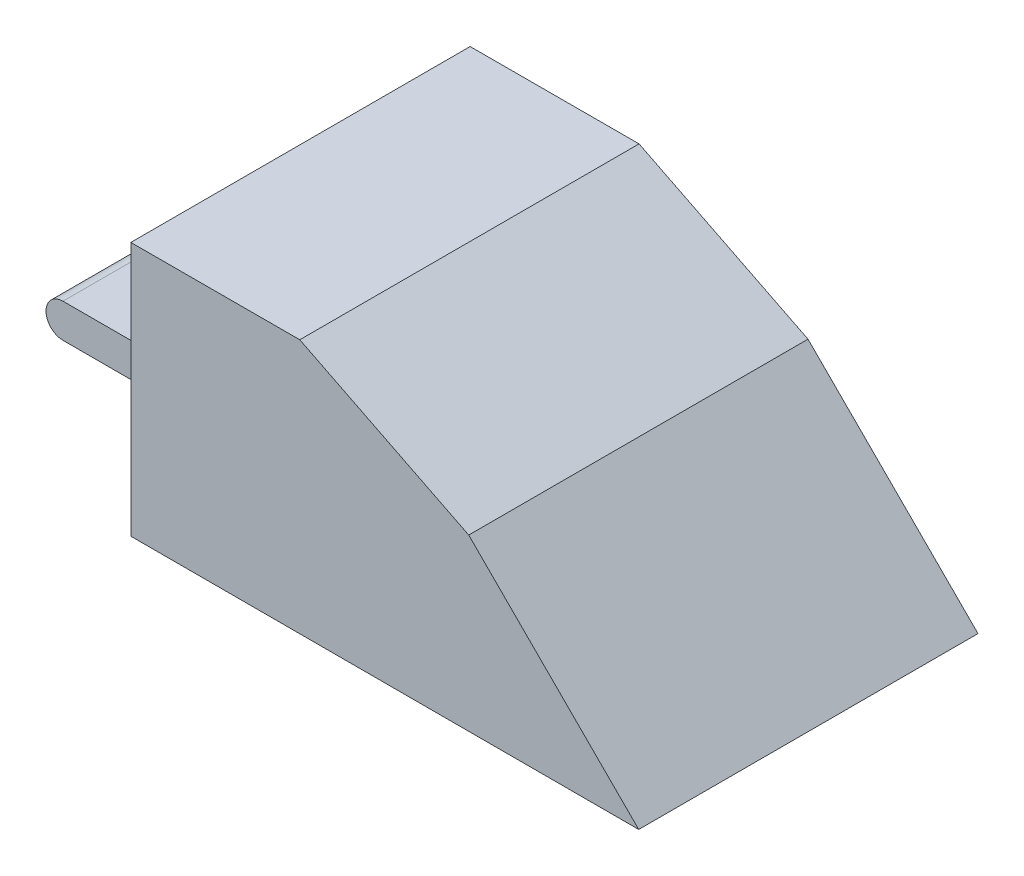
ISO-10303-21;
HEADER;
FILE_DESCRIPTION(('STEP AP214'),'2;1');
FILE_NAME('part.step','',(''),(''),'','','');
FILE_SCHEMA(('AUTOMOTIVE_DESIGN { 1 0 10303 214 1 1 1 1 }'));
ENDSEC;
DATA;
#1=APPLICATION_CONTEXT('core data for automotive mechanical design processes');
#2=APPLICATION_PROTOCOL_DEFINITION('international standard','automotive_design',2000,#1);
#3=PRODUCT_CONTEXT('',#1,'mechanical');
#4=PRODUCT('Part','Part','',(#3));
#5=PRODUCT_RELATED_PRODUCT_CATEGORY('part','',(#4));
#6=PRODUCT_DEFINITION_FORMATION('','',#4);
#7=PRODUCT_DEFINITION_CONTEXT('part definition',#1,'design');
#8=PRODUCT_DEFINITION('design','',#6,#7);
#9=PRODUCT_DEFINITION_SHAPE('','',#8);
#10=(LENGTH_UNIT() NAMED_UNIT(*) SI_UNIT(.MILLI.,.METRE.));
#11=(NAMED_UNIT(*) PLANE_ANGLE_UNIT() SI_UNIT($,.RADIAN.));
#12=(NAMED_UNIT(*) SI_UNIT($,.STERADIAN.) SOLID_ANGLE_UNIT());
#13=UNCERTAINTY_MEASURE_WITH_UNIT(LENGTH_MEASURE(1.E-05),#10,'distance_accuracy_value','');
#14=(GEOMETRIC_REPRESENTATION_CONTEXT(3) GLOBAL_UNCERTAINTY_ASSIGNED_CONTEXT((#13)) GLOBAL_UNIT_ASSIGNED_CONTEXT((#10,
#11,#12)) REPRESENTATION_CONTEXT('',''));
#15=CARTESIAN_POINT('',(0.,0.,0.));
#16=DIRECTION('',(0.,0.,1.));
#17=DIRECTION('',(1.,0.,0.));
#18=AXIS2_PLACEMENT_3D('',#15,#16,#17);
#19=CARTESIAN_POINT('',(-1.99999999999999,20.,-10.));
#20=DIRECTION('',(1.,0.,0.));
#21=DIRECTION('',(0.,0.,-1.));
#22=AXIS2_PLACEMENT_3D('',#19,#20,#21);
#23=PLANE('',#22);
#24=DIRECTION('',(0.,-1.,0.));
#25=VECTOR('',#24,1.);
#26=CARTESIAN_POINT('',(-1.99999999999999,20.,10.));
#27=LINE('',#26,#25);
#28=CARTESIAN_POINT('',(-1.99999999999999,15.,10.));
#29=VERTEX_POINT('',#28);
#30=CARTESIAN_POINT('',(-1.99999999999999,0.,10.));
#31=VERTEX_POINT('',#30);
#32=EDGE_CURVE('E41',#29,#31,#27,.T.);
#33=ORIENTED_EDGE('',*,*,#32,.F.);
#34=DIRECTION('',(0.,0.,1.));
#35=VECTOR('',#34,1.);
#36=CARTESIAN_POINT('',(-1.99999999999999,15.,-10.));
#37=LINE('',#36,#35);
#38=CARTESIAN_POINT('',(-1.99999999999999,15.,-10.));
#39=VERTEX_POINT('',#38);
#40=EDGE_CURVE('E120',#39,#29,#37,.T.);
#41=ORIENTED_EDGE('',*,*,#40,.F.);
#42=DIRECTION('',(0.,-1.,0.));
#43=VECTOR('',#42,1.);
#44=CARTESIAN_POINT('',(-1.99999999999999,20.,-10.));
#45=LINE('',#44,#43);
#46=CARTESIAN_POINT('',(-1.99999999999999,0.,-10.));
#47=VERTEX_POINT('',#46);
#48=EDGE_CURVE('E130',#39,#47,#45,.T.);
#49=ORIENTED_EDGE('',*,*,#48,.T.);
#50=DIRECTION('',(0.,0.,1.));
#51=VECTOR('',#50,1.);
#52=CARTESIAN_POINT('',(-1.99999999999999,0.,-10.));
#53=LINE('',#52,#51);
#54=CARTESIAN_POINT('',(-1.99999999999999,0.,-4.));
#55=VERTEX_POINT('',#54);
#56=EDGE_CURVE('E146',#47,#55,#53,.T.);
#57=ORIENTED_EDGE('',*,*,#56,.T.);
#58=DIRECTION('',(0.,-1.,0.));
#59=VECTOR('',#58,1.);
#60=CARTESIAN_POINT('',(-1.99999999999999,0.,-4.));
#61=LINE('',#60,#59);
#62=CARTESIAN_POINT('',(-1.99999999999999,4.,-4.));
#63=VERTEX_POINT('',#62);
#64=EDGE_CURVE('E56',#63,#55,#61,.T.);
#65=ORIENTED_EDGE('',*,*,#64,.F.);
#66=DIRECTION('',(0.,0.,-1.));
#67=VECTOR('',#66,1.);
#68=CARTESIAN_POINT('',(-1.99999999999999,4.,-4.));
#69=LINE('',#68,#67);
#70=CARTESIAN_POINT('',(-1.99999999999999,4.,4.));
#71=VERTEX_POINT('',#70);
#72=EDGE_CURVE('E160',#71,#63,#69,.T.);
#73=ORIENTED_EDGE('',*,*,#72,.F.);
#74=DIRECTION('',(0.,1.,0.));
#75=VECTOR('',#74,1.);
#76=CARTESIAN_POINT('',(-1.99999999999999,0.,4.));
#77=LINE('',#76,#75);
#78=CARTESIAN_POINT('',(-1.99999999999999,0.,4.));
#79=VERTEX_POINT('',#78);
#80=EDGE_CURVE('E162',#79,#71,#77,.T.);
#81=ORIENTED_EDGE('',*,*,#80,.F.);
#82=EDGE_CURVE('E148',#79,#31,#53,.T.);
#83=ORIENTED_EDGE('',*,*,#82,.T.);
#84=EDGE_LOOP('',(#33,#41,#49,#57,#65,#73,#81,#83));
#85=FACE_BOUND('',#84,.T.);
#86=ADVANCED_FACE('F34',(#85),#23,.F.);
#87=CARTESIAN_POINT('',(-1.99999999999999,20.,10.));
#88=DIRECTION('',(0.,0.,-1.));
#89=DIRECTION('',(-1.,0.,0.));
#90=AXIS2_PLACEMENT_3D('',#87,#88,#89);
#91=PLANE('',#90);
#92=DIRECTION('',(1.,0.,0.));
#93=VECTOR('',#92,1.);
#94=CARTESIAN_POINT('',(-1.99999999999999,0.,10.));
#95=LINE('',#94,#93);
#96=CARTESIAN_POINT('',(27.9390915984607,0.,10.));
#97=VERTEX_POINT('',#96);
#98=EDGE_CURVE('E141',#31,#97,#95,.T.);
#99=ORIENTED_EDGE('',*,*,#98,.T.);
#100=DIRECTION('',(0.707106781186556,-0.707106781186539,0.));
#101=VECTOR('',#100,1.);
#102=CARTESIAN_POINT('',(17.9187887979473,10.0203028005132,10.));
#103=LINE('',#102,#101);
#104=CARTESIAN_POINT('',(17.9187887979473,10.0203028005132,10.));
#105=VERTEX_POINT('',#104);
#106=EDGE_CURVE('E48',#105,#97,#103,.T.);
#107=ORIENTED_EDGE('',*,*,#106,.F.);
#108=DIRECTION('',(0.894062374329235,-0.44794248605013,0.));
#109=VECTOR('',#108,1.);
#110=CARTESIAN_POINT('',(17.9187887979473,10.0203028005132,10.));
#111=LINE('',#110,#109);
#112=CARTESIAN_POINT('',(7.95939439897367,15.0101514002566,10.));
#113=VERTEX_POINT('',#112);
#114=EDGE_CURVE('E195',#113,#105,#111,.T.);
#115=ORIENTED_EDGE('',*,*,#114,.F.);
#116=DIRECTION('',(0.999999480535699,0.00101927833928746,0.));
#117=VECTOR('',#116,1.);
#118=CARTESIAN_POINT('',(-1.99999999999999,15.,10.));
#119=LINE('',#118,#117);
#120=EDGE_CURVE('E198',#29,#113,#119,.T.);
#121=ORIENTED_EDGE('',*,*,#120,.F.);
#122=ORIENTED_EDGE('',*,*,#32,.T.);
#123=EDGE_LOOP('',(#99,#107,#115,#121,#122));
#124=FACE_BOUND('',#123,.T.);
#125=ADVANCED_FACE('F211',(#124),#91,.F.);
#126=CARTESIAN_POINT('',(-1.99999999999999,20.,-10.));
#127=DIRECTION('',(0.,0.,1.));
#128=DIRECTION('',(1.,0.,0.));
#129=AXIS2_PLACEMENT_3D('',#126,#127,#128);
#130=PLANE('',#129);
#131=DIRECTION('',(0.894062374329235,-0.44794248605013,0.));
#132=VECTOR('',#131,1.);
#133=CARTESIAN_POINT('',(17.9187887979473,10.0203028005132,-10.));
#134=LINE('',#133,#132);
#135=CARTESIAN_POINT('',(7.95939439897367,15.0101514002566,-10.));
#136=VERTEX_POINT('',#135);
#137=CARTESIAN_POINT('',(17.9187887979473,10.0203028005132,-10.));
#138=VERTEX_POINT('',#137);
#139=EDGE_CURVE('E127',#136,#138,#134,.T.);
#140=ORIENTED_EDGE('',*,*,#139,.T.);
#141=DIRECTION('',(0.707106781186556,-0.707106781186539,0.));
#142=VECTOR('',#141,1.);
#143=CARTESIAN_POINT('',(17.9187887979473,10.0203028005132,-10.));
#144=LINE('',#143,#142);
#145=CARTESIAN_POINT('',(27.9390915984607,0.,-10.));
#146=VERTEX_POINT('',#145);
#147=EDGE_CURVE('E133',#138,#146,#144,.T.);
#148=ORIENTED_EDGE('',*,*,#147,.T.);
#149=DIRECTION('',(-1.,0.,0.));
#150=VECTOR('',#149,1.);
#151=CARTESIAN_POINT('',(-1.99999999999999,0.,-10.));
#152=LINE('',#151,#150);
#153=EDGE_CURVE('E138',#146,#47,#152,.T.);
#154=ORIENTED_EDGE('',*,*,#153,.T.);
#155=ORIENTED_EDGE('',*,*,#48,.F.);
#156=DIRECTION('',(0.999999480535699,0.00101927833928746,0.));
#157=VECTOR('',#156,1.);
#158=CARTESIAN_POINT('',(-1.99999999999999,15.,-10.));
#159=LINE('',#158,#157);
#160=EDGE_CURVE('E116',#39,#136,#159,.T.);
#161=ORIENTED_EDGE('',*,*,#160,.T.);
#162=EDGE_LOOP('',(#140,#148,#154,#155,#161));
#163=FACE_BOUND('',#162,.T.);
#164=ADVANCED_FACE('F135',(#163),#130,.F.);
#165=CARTESIAN_POINT('',(0.,0.,0.));
#166=DIRECTION('',(0.,1.,0.));
#167=DIRECTION('',(0.,0.,1.));
#168=AXIS2_PLACEMENT_3D('',#165,#166,#167);
#169=PLANE('',#168);
#170=ORIENTED_EDGE('',*,*,#153,.F.);
#171=DIRECTION('',(0.,0.,1.));
#172=VECTOR('',#171,1.);
#173=CARTESIAN_POINT('',(27.9390915984607,0.,-10.));
#174=LINE('',#173,#172);
#175=EDGE_CURVE('E187',#146,#97,#174,.T.);
#176=ORIENTED_EDGE('',*,*,#175,.T.);
#177=ORIENTED_EDGE('',*,*,#98,.F.);
#178=ORIENTED_EDGE('',*,*,#82,.F.);
#179=DIRECTION('',(1.,0.,0.));
#180=VECTOR('',#179,1.);
#181=CARTESIAN_POINT('',(-12.,0.,4.));
#182=LINE('',#181,#180);
#183=CARTESIAN_POINT('',(-5.,0.,4.));
#184=VERTEX_POINT('',#183);
#185=EDGE_CURVE('E151',#184,#79,#182,.T.);
#186=ORIENTED_EDGE('',*,*,#185,.F.);
#187=DIRECTION('',(0.,0.,1.));
#188=VECTOR('',#187,1.);
#189=CARTESIAN_POINT('',(-5.,0.,-16.));
#190=LINE('',#189,#188);
#191=CARTESIAN_POINT('',(-5.,0.,-4.));
#192=VERTEX_POINT('',#191);
#193=EDGE_CURVE('E174',#192,#184,#190,.T.);
#194=ORIENTED_EDGE('',*,*,#193,.F.);
#195=DIRECTION('',(1.,0.,0.));
#196=VECTOR('',#195,1.);
#197=CARTESIAN_POINT('',(-12.,0.,-4.));
#198=LINE('',#197,#196);
#199=EDGE_CURVE('E149',#192,#55,#198,.T.);
#200=ORIENTED_EDGE('',*,*,#199,.T.);
#201=ORIENTED_EDGE('',*,*,#56,.F.);
#202=EDGE_LOOP('',(#170,#176,#177,#178,#186,#194,#200,#201));
#203=FACE_BOUND('',#202,.T.);
#204=ADVANCED_FACE('F208',(#203),#169,.F.);
#205=CARTESIAN_POINT('',(-12.,0.,-4.));
#206=DIRECTION('',(0.,0.,1.));
#207=DIRECTION('',(1.,0.,0.));
#208=AXIS2_PLACEMENT_3D('',#205,#206,#207);
#209=PLANE('',#208);
#210=DIRECTION('',(-1.,0.,0.));
#211=VECTOR('',#210,1.);
#212=CARTESIAN_POINT('',(-12.,2.,-4.));
#213=LINE('',#212,#211);
#214=CARTESIAN_POINT('',(-5.,2.,-4.));
#215=VERTEX_POINT('',#214);
#216=CARTESIAN_POINT('',(-12.,2.,-4.));
#217=VERTEX_POINT('',#216);
#218=EDGE_CURVE('E171',#215,#217,#213,.T.);
#219=ORIENTED_EDGE('',*,*,#218,.T.);
#220=CARTESIAN_POINT('',(-12.,3.,-4.));
#221=DIRECTION('',(0.,0.,1.));
#222=DIRECTION('',(1.,0.,0.));
#223=AXIS2_PLACEMENT_3D('',#220,#221,#222);
#224=CIRCLE('',#223,1.);
#225=CARTESIAN_POINT('',(-12.,4.,-4.));
#226=VERTEX_POINT('',#225);
#227=EDGE_CURVE('E183',#226,#217,#224,.T.);
#228=ORIENTED_EDGE('',*,*,#227,.F.);
#229=DIRECTION('',(1.,0.,0.));
#230=VECTOR('',#229,1.);
#231=CARTESIAN_POINT('',(-12.,4.,-4.));
#232=LINE('',#231,#230);
#233=EDGE_CURVE('E156',#226,#63,#232,.T.);
#234=ORIENTED_EDGE('',*,*,#233,.T.);
#235=ORIENTED_EDGE('',*,*,#64,.T.);
#236=ORIENTED_EDGE('',*,*,#199,.F.);
#237=CARTESIAN_POINT('',(-5.,1.,-4.));
#238=DIRECTION('',(0.,0.,1.));
#239=DIRECTION('',(1.,0.,0.));
#240=AXIS2_PLACEMENT_3D('',#237,#238,#239);
#241=CIRCLE('',#240,1.);
#242=EDGE_CURVE('E166',#192,#215,#241,.F.);
#243=ORIENTED_EDGE('',*,*,#242,.T.);
#244=EDGE_LOOP('',(#219,#228,#234,#235,#236,#243));
#245=FACE_BOUND('',#244,.T.);
#246=ADVANCED_FACE('F224',(#245),#209,.F.);
#247=CARTESIAN_POINT('',(-12.,0.,4.));
#248=DIRECTION('',(0.,0.,-1.));
#249=DIRECTION('',(-1.,0.,0.));
#250=AXIS2_PLACEMENT_3D('',#247,#248,#249);
#251=PLANE('',#250);
#252=DIRECTION('',(1.,0.,0.));
#253=VECTOR('',#252,1.);
#254=CARTESIAN_POINT('',(-12.,4.,4.));
#255=LINE('',#254,#253);
#256=CARTESIAN_POINT('',(-12.,4.,4.));
#257=VERTEX_POINT('',#256);
#258=EDGE_CURVE('E153',#257,#71,#255,.T.);
#259=ORIENTED_EDGE('',*,*,#258,.F.);
#260=CARTESIAN_POINT('',(-12.,3.,4.));
#261=DIRECTION('',(0.,0.,1.));
#262=DIRECTION('',(1.,0.,0.));
#263=AXIS2_PLACEMENT_3D('',#260,#261,#262);
#264=CIRCLE('',#263,1.);
#265=CARTESIAN_POINT('',(-12.,2.,4.));
#266=VERTEX_POINT('',#265);
#267=EDGE_CURVE('E184',#257,#266,#264,.T.);
#268=ORIENTED_EDGE('',*,*,#267,.T.);
#269=DIRECTION('',(-1.,0.,0.));
#270=VECTOR('',#269,1.);
#271=CARTESIAN_POINT('',(-5.,2.,4.));
#272=LINE('',#271,#270);
#273=CARTESIAN_POINT('',(-5.,2.,4.));
#274=VERTEX_POINT('',#273);
#275=EDGE_CURVE('E177',#274,#266,#272,.T.);
#276=ORIENTED_EDGE('',*,*,#275,.F.);
#277=CARTESIAN_POINT('',(-5.,1.,4.));
#278=DIRECTION('',(0.,0.,-1.));
#279=DIRECTION('',(1.,0.,0.));
#280=AXIS2_PLACEMENT_3D('',#277,#278,#279);
#281=CIRCLE('',#280,1.);
#282=EDGE_CURVE('E180',#184,#274,#281,.T.);
#283=ORIENTED_EDGE('',*,*,#282,.F.);
#284=ORIENTED_EDGE('',*,*,#185,.T.);
#285=ORIENTED_EDGE('',*,*,#80,.T.);
#286=EDGE_LOOP('',(#259,#268,#276,#283,#284,#285));
#287=FACE_BOUND('',#286,.T.);
#288=ADVANCED_FACE('F218',(#287),#251,.F.);
#289=CARTESIAN_POINT('',(-12.,4.,-4.));
#290=DIRECTION('',(0.,-1.,0.));
#291=DIRECTION('',(0.,0.,-1.));
#292=AXIS2_PLACEMENT_3D('',#289,#290,#291);
#293=PLANE('',#292);
#294=ORIENTED_EDGE('',*,*,#72,.T.);
#295=ORIENTED_EDGE('',*,*,#233,.F.);
#296=DIRECTION('',(0.,0.,-1.));
#297=VECTOR('',#296,1.);
#298=CARTESIAN_POINT('',(-12.,4.,-4.));
#299=LINE('',#298,#297);
#300=EDGE_CURVE('E159',#257,#226,#299,.T.);
#301=ORIENTED_EDGE('',*,*,#300,.F.);
#302=ORIENTED_EDGE('',*,*,#258,.T.);
#303=EDGE_LOOP('',(#294,#295,#301,#302));
#304=FACE_BOUND('',#303,.T.);
#305=ADVANCED_FACE('F228',(#304),#293,.F.);
#306=CARTESIAN_POINT('',(-5.,1.,-16.));
#307=DIRECTION('',(0.,0.,1.));
#308=DIRECTION('',(1.,0.,0.));
#309=AXIS2_PLACEMENT_3D('',#306,#307,#308);
#310=CYLINDRICAL_SURFACE('',#309,1.);
#311=ORIENTED_EDGE('',*,*,#193,.T.);
#312=ORIENTED_EDGE('',*,*,#282,.T.);
#313=DIRECTION('',(0.,0.,1.));
#314=VECTOR('',#313,1.);
#315=CARTESIAN_POINT('',(-5.,2.,-16.));
#316=LINE('',#315,#314);
#317=EDGE_CURVE('E175',#215,#274,#316,.T.);
#318=ORIENTED_EDGE('',*,*,#317,.F.);
#319=ORIENTED_EDGE('',*,*,#242,.F.);
#320=EDGE_LOOP('',(#311,#312,#318,#319));
#321=FACE_BOUND('',#320,.T.);
#322=ADVANCED_FACE('F222',(#321),#310,.T.);
#323=CARTESIAN_POINT('',(-5.,2.,-16.));
#324=DIRECTION('',(0.,1.,0.));
#325=DIRECTION('',(0.,0.,1.));
#326=AXIS2_PLACEMENT_3D('',#323,#324,#325);
#327=PLANE('',#326);
#328=ORIENTED_EDGE('',*,*,#317,.T.);
#329=ORIENTED_EDGE('',*,*,#275,.T.);
#330=DIRECTION('',(0.,0.,1.));
#331=VECTOR('',#330,1.);
#332=CARTESIAN_POINT('',(-12.,2.,0.));
#333=LINE('',#332,#331);
#334=EDGE_CURVE('E11',#217,#266,#333,.T.);
#335=ORIENTED_EDGE('',*,*,#334,.F.);
#336=ORIENTED_EDGE('',*,*,#218,.F.);
#337=EDGE_LOOP('',(#328,#329,#335,#336));
#338=FACE_BOUND('',#337,.T.);
#339=ADVANCED_FACE('F233',(#338),#327,.F.);
#340=CARTESIAN_POINT('',(-12.,3.,-4.));
#341=DIRECTION('',(0.,0.,1.));
#342=DIRECTION('',(1.,0.,0.));
#343=AXIS2_PLACEMENT_3D('',#340,#341,#342);
#344=CYLINDRICAL_SURFACE('',#343,1.);
#345=ORIENTED_EDGE('',*,*,#300,.T.);
#346=ORIENTED_EDGE('',*,*,#227,.T.);
#347=ORIENTED_EDGE('',*,*,#334,.T.);
#348=ORIENTED_EDGE('',*,*,#267,.F.);
#349=EDGE_LOOP('',(#345,#346,#347,#348));
#350=FACE_BOUND('',#349,.T.);
#351=ADVANCED_FACE('F231',(#350),#344,.T.);
#352=CARTESIAN_POINT('',(17.9187887979473,10.0203028005132,-10.));
#353=DIRECTION('',(-0.707106781186539,-0.707106781186556,0.));
#354=DIRECTION('',(0.707106781186556,-0.707106781186539,0.));
#355=AXIS2_PLACEMENT_3D('',#352,#353,#354);
#356=PLANE('',#355);
#357=ORIENTED_EDGE('',*,*,#106,.T.);
#358=ORIENTED_EDGE('',*,*,#175,.F.);
#359=ORIENTED_EDGE('',*,*,#147,.F.);
#360=DIRECTION('',(0.,0.,1.));
#361=VECTOR('',#360,1.);
#362=CARTESIAN_POINT('',(17.9187887979473,10.0203028005132,-10.));
#363=LINE('',#362,#361);
#364=EDGE_CURVE('E191',#138,#105,#363,.T.);
#365=ORIENTED_EDGE('',*,*,#364,.T.);
#366=EDGE_LOOP('',(#357,#358,#359,#365));
#367=FACE_BOUND('',#366,.T.);
#368=ADVANCED_FACE('F205',(#367),#356,.F.);
#369=CARTESIAN_POINT('',(17.9187887979473,10.0203028005132,-10.));
#370=DIRECTION('',(-0.44794248605013,-0.894062374329235,0.));
#371=DIRECTION('',(0.894062374329235,-0.44794248605013,0.));
#372=AXIS2_PLACEMENT_3D('',#369,#370,#371);
#373=PLANE('',#372);
#374=ORIENTED_EDGE('',*,*,#114,.T.);
#375=ORIENTED_EDGE('',*,*,#364,.F.);
#376=ORIENTED_EDGE('',*,*,#139,.F.);
#377=DIRECTION('',(0.,0.,1.));
#378=VECTOR('',#377,1.);
#379=CARTESIAN_POINT('',(7.95939439897367,15.0101514002566,-10.));
#380=LINE('',#379,#378);
#381=EDGE_CURVE('E122',#136,#113,#380,.T.);
#382=ORIENTED_EDGE('',*,*,#381,.T.);
#383=EDGE_LOOP('',(#374,#375,#376,#382));
#384=FACE_BOUND('',#383,.T.);
#385=ADVANCED_FACE('F203',(#384),#373,.F.);
#386=CARTESIAN_POINT('',(-1.99999999999999,15.,-10.));
#387=DIRECTION('',(0.00101927833928746,-0.999999480535699,0.));
#388=DIRECTION('',(0.999999480535699,0.00101927833928746,0.));
#389=AXIS2_PLACEMENT_3D('',#386,#387,#388);
#390=PLANE('',#389);
#391=ORIENTED_EDGE('',*,*,#120,.T.);
#392=ORIENTED_EDGE('',*,*,#381,.F.);
#393=ORIENTED_EDGE('',*,*,#160,.F.);
#394=ORIENTED_EDGE('',*,*,#40,.T.);
#395=EDGE_LOOP('',(#391,#392,#393,#394));
#396=FACE_BOUND('',#395,.T.);
#397=ADVANCED_FACE('F119',(#396),#390,.F.);
#398=CLOSED_SHELL('',(#86,#125,#164,#204,#246,#288,#305,#322,#339,#351,#368,#385,#397));
#399=MANIFOLD_SOLID_BREP('B2',#398);
#400=ADVANCED_BREP_SHAPE_REPRESENTATION('',(#18,#399),#14);
#401=SHAPE_DEFINITION_REPRESENTATION(#9,#400);
ENDSEC;
END-ISO-10303-21;
